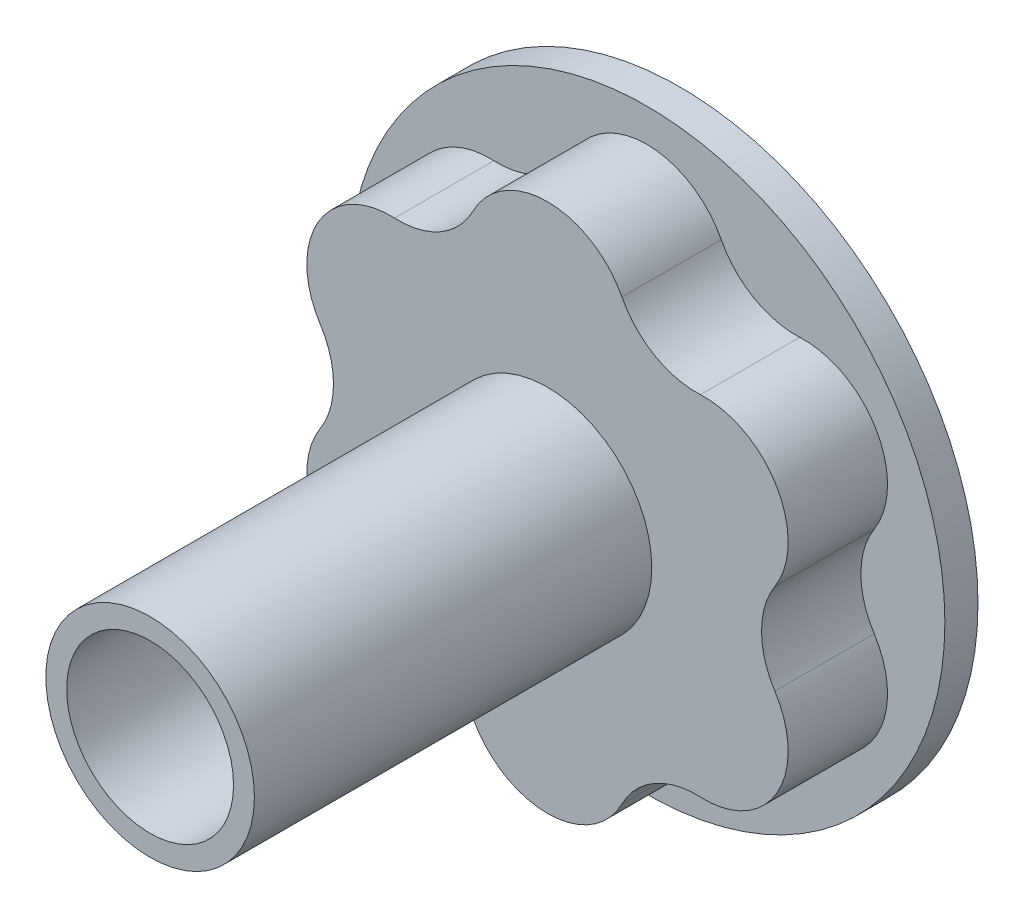
ISO-10303-21;
HEADER;
FILE_DESCRIPTION(('STEP AP214'),'2;1');
FILE_NAME('part.step','',(''),(''),'','','');
FILE_SCHEMA(('AUTOMOTIVE_DESIGN { 1 0 10303 214 1 1 1 1 }'));
ENDSEC;
DATA;
#1=APPLICATION_CONTEXT('core data for automotive mechanical design processes');
#2=APPLICATION_PROTOCOL_DEFINITION('international standard','automotive_design',2000,#1);
#3=PRODUCT_CONTEXT('',#1,'mechanical');
#4=PRODUCT('Part','Part','',(#3));
#5=PRODUCT_RELATED_PRODUCT_CATEGORY('part','',(#4));
#6=PRODUCT_DEFINITION_FORMATION('','',#4);
#7=PRODUCT_DEFINITION_CONTEXT('part definition',#1,'design');
#8=PRODUCT_DEFINITION('design','',#6,#7);
#9=PRODUCT_DEFINITION_SHAPE('','',#8);
#10=(LENGTH_UNIT() NAMED_UNIT(*) SI_UNIT(.MILLI.,.METRE.));
#11=(NAMED_UNIT(*) PLANE_ANGLE_UNIT() SI_UNIT($,.RADIAN.));
#12=(NAMED_UNIT(*) SI_UNIT($,.STERADIAN.) SOLID_ANGLE_UNIT());
#13=UNCERTAINTY_MEASURE_WITH_UNIT(LENGTH_MEASURE(1.E-05),#10,'distance_accuracy_value','');
#14=(GEOMETRIC_REPRESENTATION_CONTEXT(3) GLOBAL_UNCERTAINTY_ASSIGNED_CONTEXT((#13)) GLOBAL_UNIT_ASSIGNED_CONTEXT((#10,
#11,#12)) REPRESENTATION_CONTEXT('',''));
#15=CARTESIAN_POINT('',(0.,0.,0.));
#16=DIRECTION('',(0.,0.,1.));
#17=DIRECTION('',(1.,0.,0.));
#18=AXIS2_PLACEMENT_3D('',#15,#16,#17);
#19=CARTESIAN_POINT('',(0.,0.,4.7625));
#20=DIRECTION('',(0.,0.,-1.));
#21=DIRECTION('',(-1.,0.,0.));
#22=AXIS2_PLACEMENT_3D('',#19,#20,#21);
#23=CYLINDRICAL_SURFACE('',#22,3.);
#24=CARTESIAN_POINT('',(0.,0.,-1.5875));
#25=DIRECTION('',(0.,0.,-1.));
#26=DIRECTION('',(-1.,0.,0.));
#27=AXIS2_PLACEMENT_3D('',#24,#25,#26);
#28=CIRCLE('',#27,3.);
#29=CARTESIAN_POINT('',(-3.,0.,-1.5875));
#30=VERTEX_POINT('',#29);
#31=EDGE_CURVE('E239',#30,#30,#28,.T.);
#32=ORIENTED_EDGE('',*,*,#31,.T.);
#33=EDGE_LOOP('',(#32));
#34=FACE_BOUND('',#33,.T.);
#35=CARTESIAN_POINT('',(0.,0.,14.2875));
#36=DIRECTION('',(0.,0.,1.));
#37=DIRECTION('',(1.,0.,0.));
#38=AXIS2_PLACEMENT_3D('',#35,#36,#37);
#39=CIRCLE('',#38,3.);
#40=CARTESIAN_POINT('',(3.,0.,14.2875));
#41=VERTEX_POINT('',#40);
#42=EDGE_CURVE('E38',#41,#41,#39,.T.);
#43=ORIENTED_EDGE('',*,*,#42,.T.);
#44=EDGE_LOOP('',(#43));
#45=FACE_BOUND('',#44,.T.);
#46=ADVANCED_FACE('F34',(#34,#45),#23,.F.);
#47=CARTESIAN_POINT('',(-3.56859262190217,10.5239157612034,4.7625));
#48=DIRECTION('',(0.,0.,1.));
#49=DIRECTION('',(1.,0.,0.));
#50=AXIS2_PLACEMENT_3D('',#47,#48,#49);
#51=PLANE('',#50);
#52=CARTESIAN_POINT('',(-7.13718524380433,12.3619674653,4.7625));
#53=DIRECTION('',(0.,0.,-1.));
#54=DIRECTION('',(1.,0.,0.));
#55=AXIS2_PLACEMENT_3D('',#52,#53,#54);
#56=CIRCLE('',#55,4.0141359428932);
#57=CARTESIAN_POINT('',(-3.56859262190216,10.5239157612034,4.7625));
#58=VERTEX_POINT('',#57);
#59=CARTESIAN_POINT('',(-7.32968208553849,8.35244974692671,4.7625));
#60=VERTEX_POINT('',#59);
#61=EDGE_CURVE('E174',#58,#60,#56,.T.);
#62=ORIENTED_EDGE('',*,*,#61,.T.);
#63=CARTESIAN_POINT('',(-7.52217892727266,4.34293202855341,4.7625));
#64=DIRECTION('',(0.,0.,1.));
#65=DIRECTION('',(-1.,0.,0.));
#66=AXIS2_PLACEMENT_3D('',#63,#64,#65);
#67=CIRCLE('',#66,4.0141359428932);
#68=CARTESIAN_POINT('',(-10.8982747074407,2.17146601427671,4.7625));
#69=VERTEX_POINT('',#68);
#70=EDGE_CURVE('E134',#60,#69,#67,.T.);
#71=ORIENTED_EDGE('',*,*,#70,.T.);
#72=CARTESIAN_POINT('',(-14.2743704876087,0.,4.7625));
#73=DIRECTION('',(0.,0.,-1.));
#74=DIRECTION('',(1.,0.,0.));
#75=AXIS2_PLACEMENT_3D('',#72,#73,#74);
#76=CIRCLE('',#75,4.0141359428932);
#77=CARTESIAN_POINT('',(-10.8982747074407,-2.1714660142767,4.7625));
#78=VERTEX_POINT('',#77);
#79=EDGE_CURVE('E207',#69,#78,#76,.T.);
#80=ORIENTED_EDGE('',*,*,#79,.T.);
#81=CARTESIAN_POINT('',(-7.52217892727266,-4.3429320285534,4.7625));
#82=DIRECTION('',(0.,0.,1.));
#83=DIRECTION('',(-1.,0.,0.));
#84=AXIS2_PLACEMENT_3D('',#81,#82,#83);
#85=CIRCLE('',#84,4.0141359428932);
#86=CARTESIAN_POINT('',(-7.32968208553851,-8.3524497469267,4.7625));
#87=VERTEX_POINT('',#86);
#88=EDGE_CURVE('E209',#78,#87,#85,.T.);
#89=ORIENTED_EDGE('',*,*,#88,.T.);
#90=CARTESIAN_POINT('',(-7.13718524380435,-12.3619674653,4.7625));
#91=DIRECTION('',(0.,0.,-1.));
#92=DIRECTION('',(1.,0.,0.));
#93=AXIS2_PLACEMENT_3D('',#90,#91,#92);
#94=CIRCLE('',#93,4.0141359428932);
#95=CARTESIAN_POINT('',(-3.56859262190217,-10.5239157612034,4.7625));
#96=VERTEX_POINT('',#95);
#97=EDGE_CURVE('E211',#87,#96,#94,.T.);
#98=ORIENTED_EDGE('',*,*,#97,.T.);
#99=CARTESIAN_POINT('',(0.,-8.6858640571068,4.7625));
#100=DIRECTION('',(0.,0.,1.));
#101=DIRECTION('',(-1.,0.,0.));
#102=AXIS2_PLACEMENT_3D('',#99,#100,#101);
#103=CIRCLE('',#102,4.0141359428932);
#104=CARTESIAN_POINT('',(3.56859262190218,-10.5239157612034,4.7625));
#105=VERTEX_POINT('',#104);
#106=EDGE_CURVE('E217',#96,#105,#103,.T.);
#107=ORIENTED_EDGE('',*,*,#106,.T.);
#108=CARTESIAN_POINT('',(7.13718524380436,-12.3619674653,4.7625));
#109=DIRECTION('',(0.,0.,-1.));
#110=DIRECTION('',(1.,0.,0.));
#111=AXIS2_PLACEMENT_3D('',#108,#109,#110);
#112=CIRCLE('',#111,4.0141359428932);
#113=CARTESIAN_POINT('',(7.32968208553851,-8.35244974692669,4.7625));
#114=VERTEX_POINT('',#113);
#115=EDGE_CURVE('E219',#105,#114,#112,.T.);
#116=ORIENTED_EDGE('',*,*,#115,.T.);
#117=CARTESIAN_POINT('',(7.52217892727266,-4.34293202855339,4.7625));
#118=DIRECTION('',(0.,0.,1.));
#119=DIRECTION('',(-1.,0.,0.));
#120=AXIS2_PLACEMENT_3D('',#117,#118,#119);
#121=CIRCLE('',#120,4.0141359428932);
#122=CARTESIAN_POINT('',(10.8982747074407,-2.17146601427669,4.7625));
#123=VERTEX_POINT('',#122);
#124=EDGE_CURVE('E221',#114,#123,#121,.T.);
#125=ORIENTED_EDGE('',*,*,#124,.T.);
#126=CARTESIAN_POINT('',(14.2743704876087,0.,4.7625));
#127=DIRECTION('',(0.,0.,-1.));
#128=DIRECTION('',(1.,0.,0.));
#129=AXIS2_PLACEMENT_3D('',#126,#127,#128);
#130=CIRCLE('',#129,4.0141359428932);
#131=CARTESIAN_POINT('',(10.8982747074407,2.17146601427671,4.7625));
#132=VERTEX_POINT('',#131);
#133=EDGE_CURVE('E223',#123,#132,#130,.T.);
#134=ORIENTED_EDGE('',*,*,#133,.T.);
#135=CARTESIAN_POINT('',(7.52217892727265,4.3429320285534,4.7625));
#136=DIRECTION('',(0.,0.,1.));
#137=DIRECTION('',(-1.,0.,0.));
#138=AXIS2_PLACEMENT_3D('',#135,#136,#137);
#139=CIRCLE('',#138,4.0141359428932);
#140=CARTESIAN_POINT('',(7.3296820855385,8.3524497469267,4.7625));
#141=VERTEX_POINT('',#140);
#142=EDGE_CURVE('E225',#132,#141,#139,.T.);
#143=ORIENTED_EDGE('',*,*,#142,.T.);
#144=CARTESIAN_POINT('',(7.13718524380435,12.3619674653,4.7625));
#145=DIRECTION('',(0.,0.,-1.));
#146=DIRECTION('',(1.,0.,0.));
#147=AXIS2_PLACEMENT_3D('',#144,#145,#146);
#148=CIRCLE('',#147,4.0141359428932);
#149=CARTESIAN_POINT('',(3.56859262190217,10.5239157612034,4.7625));
#150=VERTEX_POINT('',#149);
#151=EDGE_CURVE('E226',#141,#150,#148,.T.);
#152=ORIENTED_EDGE('',*,*,#151,.T.);
#153=CARTESIAN_POINT('',(0.,8.6858640571068,4.7625));
#154=DIRECTION('',(0.,0.,1.));
#155=DIRECTION('',(-1.,0.,0.));
#156=AXIS2_PLACEMENT_3D('',#153,#154,#155);
#157=CIRCLE('',#156,4.01413594289319);
#158=EDGE_CURVE('E51',#150,#58,#157,.T.);
#159=ORIENTED_EDGE('',*,*,#158,.T.);
#160=EDGE_LOOP('',(#62,#71,#80,#89,#98,#107,#116,#125,#134,#143,#152,#159));
#161=FACE_BOUND('',#160,.T.);
#162=CARTESIAN_POINT('',(0.,0.,4.7625));
#163=DIRECTION('',(0.,0.,1.));
#164=DIRECTION('',(1.,0.,0.));
#165=AXIS2_PLACEMENT_3D('',#162,#163,#164);
#166=CIRCLE('',#165,5.);
#167=CARTESIAN_POINT('',(5.,0.,4.7625));
#168=VERTEX_POINT('',#167);
#169=EDGE_CURVE('E244',#168,#168,#166,.T.);
#170=ORIENTED_EDGE('',*,*,#169,.F.);
#171=EDGE_LOOP('',(#170));
#172=FACE_BOUND('',#171,.T.);
#173=ADVANCED_FACE('F229',(#161,#172),#51,.T.);
#174=CARTESIAN_POINT('',(-7.13718524380433,12.3619674653,4.7625));
#175=DIRECTION('',(0.,0.,-1.));
#176=DIRECTION('',(-1.,0.,0.));
#177=AXIS2_PLACEMENT_3D('',#174,#175,#176);
#178=CYLINDRICAL_SURFACE('',#177,4.0141359428932);
#179=CARTESIAN_POINT('',(-7.13718524380433,12.3619674653,0.));
#180=DIRECTION('',(0.,0.,-1.));
#181=DIRECTION('',(1.,0.,0.));
#182=AXIS2_PLACEMENT_3D('',#179,#180,#181);
#183=CIRCLE('',#182,4.0141359428932);
#184=CARTESIAN_POINT('',(-3.56859262190216,10.5239157612034,0.));
#185=VERTEX_POINT('',#184);
#186=CARTESIAN_POINT('',(-7.32968208553849,8.35244974692671,0.));
#187=VERTEX_POINT('',#186);
#188=EDGE_CURVE('E124',#185,#187,#183,.T.);
#189=ORIENTED_EDGE('',*,*,#188,.T.);
#190=DIRECTION('',(0.,0.,-1.));
#191=VECTOR('',#190,1.);
#192=CARTESIAN_POINT('',(-7.32968208553849,8.35244974692671,4.7625));
#193=LINE('',#192,#191);
#194=EDGE_CURVE('E11',#60,#187,#193,.T.);
#195=ORIENTED_EDGE('',*,*,#194,.F.);
#196=ORIENTED_EDGE('',*,*,#61,.F.);
#197=DIRECTION('',(0.,0.,-1.));
#198=VECTOR('',#197,1.);
#199=CARTESIAN_POINT('',(-3.56859262190216,10.5239157612034,4.7625));
#200=LINE('',#199,#198);
#201=EDGE_CURVE('E138',#58,#185,#200,.T.);
#202=ORIENTED_EDGE('',*,*,#201,.T.);
#203=EDGE_LOOP('',(#189,#195,#196,#202));
#204=FACE_BOUND('',#203,.T.);
#205=ADVANCED_FACE('F36',(#204),#178,.F.);
#206=CARTESIAN_POINT('',(-7.52217892727266,4.34293202855341,4.7625));
#207=DIRECTION('',(0.,0.,-1.));
#208=DIRECTION('',(-1.,0.,0.));
#209=AXIS2_PLACEMENT_3D('',#206,#207,#208);
#210=CYLINDRICAL_SURFACE('',#209,4.0141359428932);
#211=CARTESIAN_POINT('',(-7.52217892727266,4.34293202855341,0.));
#212=DIRECTION('',(0.,0.,1.));
#213=DIRECTION('',(-1.,0.,0.));
#214=AXIS2_PLACEMENT_3D('',#211,#212,#213);
#215=CIRCLE('',#214,4.0141359428932);
#216=CARTESIAN_POINT('',(-10.8982747074407,2.17146601427671,0.));
#217=VERTEX_POINT('',#216);
#218=EDGE_CURVE('E120',#187,#217,#215,.T.);
#219=ORIENTED_EDGE('',*,*,#218,.T.);
#220=DIRECTION('',(0.,0.,-1.));
#221=VECTOR('',#220,1.);
#222=CARTESIAN_POINT('',(-10.8982747074407,2.17146601427671,4.7625));
#223=LINE('',#222,#221);
#224=EDGE_CURVE('E44',#69,#217,#223,.T.);
#225=ORIENTED_EDGE('',*,*,#224,.F.);
#226=ORIENTED_EDGE('',*,*,#70,.F.);
#227=ORIENTED_EDGE('',*,*,#194,.T.);
#228=EDGE_LOOP('',(#219,#225,#226,#227));
#229=FACE_BOUND('',#228,.T.);
#230=ADVANCED_FACE('F133',(#229),#210,.T.);
#231=CARTESIAN_POINT('',(-14.2743704876087,0.,4.7625));
#232=DIRECTION('',(0.,0.,-1.));
#233=DIRECTION('',(-1.,0.,0.));
#234=AXIS2_PLACEMENT_3D('',#231,#232,#233);
#235=CYLINDRICAL_SURFACE('',#234,4.0141359428932);
#236=CARTESIAN_POINT('',(-14.2743704876087,0.,0.));
#237=DIRECTION('',(0.,0.,-1.));
#238=DIRECTION('',(1.,0.,0.));
#239=AXIS2_PLACEMENT_3D('',#236,#237,#238);
#240=CIRCLE('',#239,4.0141359428932);
#241=CARTESIAN_POINT('',(-10.8982747074407,-2.1714660142767,0.));
#242=VERTEX_POINT('',#241);
#243=EDGE_CURVE('E127',#217,#242,#240,.T.);
#244=ORIENTED_EDGE('',*,*,#243,.T.);
#245=DIRECTION('',(0.,0.,-1.));
#246=VECTOR('',#245,1.);
#247=CARTESIAN_POINT('',(-10.8982747074407,-2.1714660142767,4.7625));
#248=LINE('',#247,#246);
#249=EDGE_CURVE('E200',#78,#242,#248,.T.);
#250=ORIENTED_EDGE('',*,*,#249,.F.);
#251=ORIENTED_EDGE('',*,*,#79,.F.);
#252=ORIENTED_EDGE('',*,*,#224,.T.);
#253=EDGE_LOOP('',(#244,#250,#251,#252));
#254=FACE_BOUND('',#253,.T.);
#255=ADVANCED_FACE('F205',(#254),#235,.F.);
#256=CARTESIAN_POINT('',(-7.52217892727266,-4.3429320285534,4.7625));
#257=DIRECTION('',(0.,0.,-1.));
#258=DIRECTION('',(-1.,0.,0.));
#259=AXIS2_PLACEMENT_3D('',#256,#257,#258);
#260=CYLINDRICAL_SURFACE('',#259,4.0141359428932);
#261=CARTESIAN_POINT('',(-7.52217892727266,-4.3429320285534,0.));
#262=DIRECTION('',(0.,0.,1.));
#263=DIRECTION('',(-1.,0.,0.));
#264=AXIS2_PLACEMENT_3D('',#261,#262,#263);
#265=CIRCLE('',#264,4.0141359428932);
#266=CARTESIAN_POINT('',(-7.32968208553851,-8.3524497469267,0.));
#267=VERTEX_POINT('',#266);
#268=EDGE_CURVE('E148',#242,#267,#265,.T.);
#269=ORIENTED_EDGE('',*,*,#268,.T.);
#270=DIRECTION('',(0.,0.,-1.));
#271=VECTOR('',#270,1.);
#272=CARTESIAN_POINT('',(-7.32968208553851,-8.3524497469267,4.7625));
#273=LINE('',#272,#271);
#274=EDGE_CURVE('E197',#87,#267,#273,.T.);
#275=ORIENTED_EDGE('',*,*,#274,.F.);
#276=ORIENTED_EDGE('',*,*,#88,.F.);
#277=ORIENTED_EDGE('',*,*,#249,.T.);
#278=EDGE_LOOP('',(#269,#275,#276,#277));
#279=FACE_BOUND('',#278,.T.);
#280=ADVANCED_FACE('F309',(#279),#260,.T.);
#281=CARTESIAN_POINT('',(-7.13718524380435,-12.3619674653,4.7625));
#282=DIRECTION('',(0.,0.,-1.));
#283=DIRECTION('',(-1.,0.,0.));
#284=AXIS2_PLACEMENT_3D('',#281,#282,#283);
#285=CYLINDRICAL_SURFACE('',#284,4.0141359428932);
#286=CARTESIAN_POINT('',(-7.13718524380435,-12.3619674653,0.));
#287=DIRECTION('',(0.,0.,-1.));
#288=DIRECTION('',(1.,0.,0.));
#289=AXIS2_PLACEMENT_3D('',#286,#287,#288);
#290=CIRCLE('',#289,4.0141359428932);
#291=CARTESIAN_POINT('',(-3.56859262190217,-10.5239157612034,0.));
#292=VERTEX_POINT('',#291);
#293=EDGE_CURVE('E151',#267,#292,#290,.T.);
#294=ORIENTED_EDGE('',*,*,#293,.T.);
#295=DIRECTION('',(0.,0.,-1.));
#296=VECTOR('',#295,1.);
#297=CARTESIAN_POINT('',(-3.56859262190217,-10.5239157612034,4.7625));
#298=LINE('',#297,#296);
#299=EDGE_CURVE('E194',#96,#292,#298,.T.);
#300=ORIENTED_EDGE('',*,*,#299,.F.);
#301=ORIENTED_EDGE('',*,*,#97,.F.);
#302=ORIENTED_EDGE('',*,*,#274,.T.);
#303=EDGE_LOOP('',(#294,#300,#301,#302));
#304=FACE_BOUND('',#303,.T.);
#305=ADVANCED_FACE('F305',(#304),#285,.F.);
#306=CARTESIAN_POINT('',(0.,-8.6858640571068,4.7625));
#307=DIRECTION('',(0.,0.,-1.));
#308=DIRECTION('',(-1.,0.,0.));
#309=AXIS2_PLACEMENT_3D('',#306,#307,#308);
#310=CYLINDRICAL_SURFACE('',#309,4.0141359428932);
#311=CARTESIAN_POINT('',(0.,-8.6858640571068,0.));
#312=DIRECTION('',(0.,0.,1.));
#313=DIRECTION('',(-1.,0.,0.));
#314=AXIS2_PLACEMENT_3D('',#311,#312,#313);
#315=CIRCLE('',#314,4.0141359428932);
#316=CARTESIAN_POINT('',(3.56859262190218,-10.5239157612034,0.));
#317=VERTEX_POINT('',#316);
#318=EDGE_CURVE('E154',#292,#317,#315,.T.);
#319=ORIENTED_EDGE('',*,*,#318,.T.);
#320=DIRECTION('',(0.,0.,-1.));
#321=VECTOR('',#320,1.);
#322=CARTESIAN_POINT('',(3.56859262190218,-10.5239157612034,4.7625));
#323=LINE('',#322,#321);
#324=EDGE_CURVE('E191',#105,#317,#323,.T.);
#325=ORIENTED_EDGE('',*,*,#324,.F.);
#326=ORIENTED_EDGE('',*,*,#106,.F.);
#327=ORIENTED_EDGE('',*,*,#299,.T.);
#328=EDGE_LOOP('',(#319,#325,#326,#327));
#329=FACE_BOUND('',#328,.T.);
#330=ADVANCED_FACE('F301',(#329),#310,.T.);
#331=CARTESIAN_POINT('',(7.13718524380436,-12.3619674653,4.7625));
#332=DIRECTION('',(0.,0.,-1.));
#333=DIRECTION('',(-1.,0.,0.));
#334=AXIS2_PLACEMENT_3D('',#331,#332,#333);
#335=CYLINDRICAL_SURFACE('',#334,4.0141359428932);
#336=CARTESIAN_POINT('',(7.13718524380436,-12.3619674653,0.));
#337=DIRECTION('',(0.,0.,-1.));
#338=DIRECTION('',(1.,0.,0.));
#339=AXIS2_PLACEMENT_3D('',#336,#337,#338);
#340=CIRCLE('',#339,4.0141359428932);
#341=CARTESIAN_POINT('',(7.32968208553851,-8.35244974692669,0.));
#342=VERTEX_POINT('',#341);
#343=EDGE_CURVE('E157',#317,#342,#340,.T.);
#344=ORIENTED_EDGE('',*,*,#343,.T.);
#345=DIRECTION('',(0.,0.,-1.));
#346=VECTOR('',#345,1.);
#347=CARTESIAN_POINT('',(7.32968208553851,-8.35244974692669,4.7625));
#348=LINE('',#347,#346);
#349=EDGE_CURVE('E188',#114,#342,#348,.T.);
#350=ORIENTED_EDGE('',*,*,#349,.F.);
#351=ORIENTED_EDGE('',*,*,#115,.F.);
#352=ORIENTED_EDGE('',*,*,#324,.T.);
#353=EDGE_LOOP('',(#344,#350,#351,#352));
#354=FACE_BOUND('',#353,.T.);
#355=ADVANCED_FACE('F297',(#354),#335,.F.);
#356=CARTESIAN_POINT('',(7.52217892727266,-4.34293202855339,4.7625));
#357=DIRECTION('',(0.,0.,-1.));
#358=DIRECTION('',(-1.,0.,0.));
#359=AXIS2_PLACEMENT_3D('',#356,#357,#358);
#360=CYLINDRICAL_SURFACE('',#359,4.0141359428932);
#361=CARTESIAN_POINT('',(7.52217892727266,-4.34293202855339,0.));
#362=DIRECTION('',(0.,0.,1.));
#363=DIRECTION('',(-1.,0.,0.));
#364=AXIS2_PLACEMENT_3D('',#361,#362,#363);
#365=CIRCLE('',#364,4.0141359428932);
#366=CARTESIAN_POINT('',(10.8982747074407,-2.17146601427669,0.));
#367=VERTEX_POINT('',#366);
#368=EDGE_CURVE('E160',#342,#367,#365,.T.);
#369=ORIENTED_EDGE('',*,*,#368,.T.);
#370=DIRECTION('',(0.,0.,-1.));
#371=VECTOR('',#370,1.);
#372=CARTESIAN_POINT('',(10.8982747074407,-2.17146601427669,4.7625));
#373=LINE('',#372,#371);
#374=EDGE_CURVE('E185',#123,#367,#373,.T.);
#375=ORIENTED_EDGE('',*,*,#374,.F.);
#376=ORIENTED_EDGE('',*,*,#124,.F.);
#377=ORIENTED_EDGE('',*,*,#349,.T.);
#378=EDGE_LOOP('',(#369,#375,#376,#377));
#379=FACE_BOUND('',#378,.T.);
#380=ADVANCED_FACE('F293',(#379),#360,.T.);
#381=CARTESIAN_POINT('',(14.2743704876087,0.,4.7625));
#382=DIRECTION('',(0.,0.,-1.));
#383=DIRECTION('',(-1.,0.,0.));
#384=AXIS2_PLACEMENT_3D('',#381,#382,#383);
#385=CYLINDRICAL_SURFACE('',#384,4.0141359428932);
#386=CARTESIAN_POINT('',(14.2743704876087,0.,0.));
#387=DIRECTION('',(0.,0.,-1.));
#388=DIRECTION('',(1.,0.,0.));
#389=AXIS2_PLACEMENT_3D('',#386,#387,#388);
#390=CIRCLE('',#389,4.0141359428932);
#391=CARTESIAN_POINT('',(10.8982747074407,2.17146601427671,0.));
#392=VERTEX_POINT('',#391);
#393=EDGE_CURVE('E163',#367,#392,#390,.T.);
#394=ORIENTED_EDGE('',*,*,#393,.T.);
#395=DIRECTION('',(0.,0.,-1.));
#396=VECTOR('',#395,1.);
#397=CARTESIAN_POINT('',(10.8982747074407,2.17146601427671,4.7625));
#398=LINE('',#397,#396);
#399=EDGE_CURVE('E182',#132,#392,#398,.T.);
#400=ORIENTED_EDGE('',*,*,#399,.F.);
#401=ORIENTED_EDGE('',*,*,#133,.F.);
#402=ORIENTED_EDGE('',*,*,#374,.T.);
#403=EDGE_LOOP('',(#394,#400,#401,#402));
#404=FACE_BOUND('',#403,.T.);
#405=ADVANCED_FACE('F289',(#404),#385,.F.);
#406=CARTESIAN_POINT('',(7.52217892727265,4.3429320285534,4.7625));
#407=DIRECTION('',(0.,0.,-1.));
#408=DIRECTION('',(-1.,0.,0.));
#409=AXIS2_PLACEMENT_3D('',#406,#407,#408);
#410=CYLINDRICAL_SURFACE('',#409,4.0141359428932);
#411=CARTESIAN_POINT('',(7.52217892727265,4.3429320285534,0.));
#412=DIRECTION('',(0.,0.,1.));
#413=DIRECTION('',(-1.,0.,0.));
#414=AXIS2_PLACEMENT_3D('',#411,#412,#413);
#415=CIRCLE('',#414,4.0141359428932);
#416=CARTESIAN_POINT('',(7.3296820855385,8.3524497469267,0.));
#417=VERTEX_POINT('',#416);
#418=EDGE_CURVE('E166',#392,#417,#415,.T.);
#419=ORIENTED_EDGE('',*,*,#418,.T.);
#420=DIRECTION('',(0.,0.,-1.));
#421=VECTOR('',#420,1.);
#422=CARTESIAN_POINT('',(7.3296820855385,8.3524497469267,4.7625));
#423=LINE('',#422,#421);
#424=EDGE_CURVE('E179',#141,#417,#423,.T.);
#425=ORIENTED_EDGE('',*,*,#424,.F.);
#426=ORIENTED_EDGE('',*,*,#142,.F.);
#427=ORIENTED_EDGE('',*,*,#399,.T.);
#428=EDGE_LOOP('',(#419,#425,#426,#427));
#429=FACE_BOUND('',#428,.T.);
#430=ADVANCED_FACE('F286',(#429),#410,.T.);
#431=CARTESIAN_POINT('',(7.13718524380435,12.3619674653,4.7625));
#432=DIRECTION('',(0.,0.,-1.));
#433=DIRECTION('',(-1.,0.,0.));
#434=AXIS2_PLACEMENT_3D('',#431,#432,#433);
#435=CYLINDRICAL_SURFACE('',#434,4.0141359428932);
#436=CARTESIAN_POINT('',(7.13718524380435,12.3619674653,0.));
#437=DIRECTION('',(0.,0.,-1.));
#438=DIRECTION('',(1.,0.,0.));
#439=AXIS2_PLACEMENT_3D('',#436,#437,#438);
#440=CIRCLE('',#439,4.0141359428932);
#441=CARTESIAN_POINT('',(3.56859262190217,10.5239157612034,0.));
#442=VERTEX_POINT('',#441);
#443=EDGE_CURVE('E169',#417,#442,#440,.T.);
#444=ORIENTED_EDGE('',*,*,#443,.T.);
#445=DIRECTION('',(0.,0.,-1.));
#446=VECTOR('',#445,1.);
#447=CARTESIAN_POINT('',(3.56859262190217,10.5239157612034,4.7625));
#448=LINE('',#447,#446);
#449=EDGE_CURVE('E176',#150,#442,#448,.T.);
#450=ORIENTED_EDGE('',*,*,#449,.F.);
#451=ORIENTED_EDGE('',*,*,#151,.F.);
#452=ORIENTED_EDGE('',*,*,#424,.T.);
#453=EDGE_LOOP('',(#444,#450,#451,#452));
#454=FACE_BOUND('',#453,.T.);
#455=ADVANCED_FACE('F234',(#454),#435,.F.);
#456=CARTESIAN_POINT('',(0.,8.6858640571068,4.7625));
#457=DIRECTION('',(0.,0.,-1.));
#458=DIRECTION('',(-1.,0.,0.));
#459=AXIS2_PLACEMENT_3D('',#456,#457,#458);
#460=CYLINDRICAL_SURFACE('',#459,4.01413594289319);
#461=CARTESIAN_POINT('',(0.,8.6858640571068,0.));
#462=DIRECTION('',(0.,0.,1.));
#463=DIRECTION('',(-1.,0.,0.));
#464=AXIS2_PLACEMENT_3D('',#461,#462,#463);
#465=CIRCLE('',#464,4.01413594289319);
#466=EDGE_CURVE('E172',#442,#185,#465,.T.);
#467=ORIENTED_EDGE('',*,*,#466,.T.);
#468=ORIENTED_EDGE('',*,*,#201,.F.);
#469=ORIENTED_EDGE('',*,*,#158,.F.);
#470=ORIENTED_EDGE('',*,*,#449,.T.);
#471=EDGE_LOOP('',(#467,#468,#469,#470));
#472=FACE_BOUND('',#471,.T.);
#473=ADVANCED_FACE('F236',(#472),#460,.T.);
#474=CARTESIAN_POINT('',(0.,0.,-1.5875));
#475=DIRECTION('',(0.,0.,-1.));
#476=DIRECTION('',(-1.,0.,0.));
#477=AXIS2_PLACEMENT_3D('',#474,#475,#476);
#478=PLANE('',#477);
#479=CARTESIAN_POINT('',(0.,0.,-1.5875));
#480=DIRECTION('',(0.,0.,-1.));
#481=DIRECTION('',(-1.,0.,0.));
#482=AXIS2_PLACEMENT_3D('',#479,#480,#481);
#483=CIRCLE('',#482,14.2875);
#484=CARTESIAN_POINT('',(-14.2875,0.,-1.5875));
#485=VERTEX_POINT('',#484);
#486=EDGE_CURVE('E139',#485,#485,#483,.T.);
#487=ORIENTED_EDGE('',*,*,#486,.T.);
#488=EDGE_LOOP('',(#487));
#489=FACE_BOUND('',#488,.T.);
#490=ORIENTED_EDGE('',*,*,#31,.F.);
#491=EDGE_LOOP('',(#490));
#492=FACE_BOUND('',#491,.T.);
#493=ADVANCED_FACE('F283',(#489,#492),#478,.T.);
#494=CARTESIAN_POINT('',(0.,0.,0.));
#495=DIRECTION('',(0.,0.,-1.));
#496=DIRECTION('',(-1.,0.,0.));
#497=AXIS2_PLACEMENT_3D('',#494,#495,#496);
#498=PLANE('',#497);
#499=ORIENTED_EDGE('',*,*,#188,.F.);
#500=ORIENTED_EDGE('',*,*,#466,.F.);
#501=ORIENTED_EDGE('',*,*,#443,.F.);
#502=ORIENTED_EDGE('',*,*,#418,.F.);
#503=ORIENTED_EDGE('',*,*,#393,.F.);
#504=ORIENTED_EDGE('',*,*,#368,.F.);
#505=ORIENTED_EDGE('',*,*,#343,.F.);
#506=ORIENTED_EDGE('',*,*,#318,.F.);
#507=ORIENTED_EDGE('',*,*,#293,.F.);
#508=ORIENTED_EDGE('',*,*,#268,.F.);
#509=ORIENTED_EDGE('',*,*,#243,.F.);
#510=ORIENTED_EDGE('',*,*,#218,.F.);
#511=EDGE_LOOP('',(#499,#500,#501,#502,#503,#504,#505,#506,#507,#508,#509,#510));
#512=FACE_BOUND('',#511,.T.);
#513=CARTESIAN_POINT('',(0.,0.,0.));
#514=DIRECTION('',(0.,0.,-1.));
#515=DIRECTION('',(-1.,0.,0.));
#516=AXIS2_PLACEMENT_3D('',#513,#514,#515);
#517=CIRCLE('',#516,14.2875);
#518=CARTESIAN_POINT('',(-14.2875,0.,0.));
#519=VERTEX_POINT('',#518);
#520=EDGE_CURVE('E142',#519,#519,#517,.T.);
#521=ORIENTED_EDGE('',*,*,#520,.F.);
#522=EDGE_LOOP('',(#521));
#523=FACE_BOUND('',#522,.T.);
#524=ADVANCED_FACE('F121',(#512,#523),#498,.F.);
#525=CARTESIAN_POINT('',(0.,0.,-1.5875));
#526=DIRECTION('',(0.,0.,1.));
#527=DIRECTION('',(1.,0.,0.));
#528=AXIS2_PLACEMENT_3D('',#525,#526,#527);
#529=CYLINDRICAL_SURFACE('',#528,14.2875);
#530=ORIENTED_EDGE('',*,*,#486,.F.);
#531=EDGE_LOOP('',(#530));
#532=FACE_BOUND('',#531,.T.);
#533=ORIENTED_EDGE('',*,*,#520,.T.);
#534=EDGE_LOOP('',(#533));
#535=FACE_BOUND('',#534,.T.);
#536=ADVANCED_FACE('F278',(#532,#535),#529,.T.);
#537=CARTESIAN_POINT('',(0.,0.,23.8125));
#538=DIRECTION('',(0.,0.,1.));
#539=DIRECTION('',(1.,0.,0.));
#540=AXIS2_PLACEMENT_3D('',#537,#538,#539);
#541=PLANE('',#540);
#542=CARTESIAN_POINT('',(0.,0.,23.8125));
#543=DIRECTION('',(0.,0.,1.));
#544=DIRECTION('',(1.,0.,0.));
#545=AXIS2_PLACEMENT_3D('',#542,#543,#544);
#546=CIRCLE('',#545,4.);
#547=CARTESIAN_POINT('',(4.,0.,23.8125));
#548=VERTEX_POINT('',#547);
#549=EDGE_CURVE('E249',#548,#548,#546,.T.);
#550=ORIENTED_EDGE('',*,*,#549,.F.);
#551=EDGE_LOOP('',(#550));
#552=FACE_BOUND('',#551,.T.);
#553=CARTESIAN_POINT('',(0.,0.,23.8125));
#554=DIRECTION('',(0.,0.,1.));
#555=DIRECTION('',(1.,0.,0.));
#556=AXIS2_PLACEMENT_3D('',#553,#554,#555);
#557=CIRCLE('',#556,5.);
#558=CARTESIAN_POINT('',(5.,0.,23.8125));
#559=VERTEX_POINT('',#558);
#560=EDGE_CURVE('E243',#559,#559,#557,.T.);
#561=ORIENTED_EDGE('',*,*,#560,.T.);
#562=EDGE_LOOP('',(#561));
#563=FACE_BOUND('',#562,.T.);
#564=ADVANCED_FACE('F339',(#552,#563),#541,.T.);
#565=CARTESIAN_POINT('',(0.,0.,23.8125));
#566=DIRECTION('',(0.,0.,-1.));
#567=DIRECTION('',(-1.,0.,0.));
#568=AXIS2_PLACEMENT_3D('',#565,#566,#567);
#569=CYLINDRICAL_SURFACE('',#568,5.);
#570=ORIENTED_EDGE('',*,*,#560,.F.);
#571=EDGE_LOOP('',(#570));
#572=FACE_BOUND('',#571,.T.);
#573=ORIENTED_EDGE('',*,*,#169,.T.);
#574=EDGE_LOOP('',(#573));
#575=FACE_BOUND('',#574,.T.);
#576=ADVANCED_FACE('F267',(#572,#575),#569,.T.);
#577=CARTESIAN_POINT('',(0.,0.,14.2875));
#578=DIRECTION('',(0.,0.,1.));
#579=DIRECTION('',(1.,0.,0.));
#580=AXIS2_PLACEMENT_3D('',#577,#578,#579);
#581=CYLINDRICAL_SURFACE('',#580,4.);
#582=CARTESIAN_POINT('',(0.,0.,14.2875));
#583=DIRECTION('',(0.,0.,1.));
#584=DIRECTION('',(1.,0.,0.));
#585=AXIS2_PLACEMENT_3D('',#582,#583,#584);
#586=CIRCLE('',#585,4.);
#587=CARTESIAN_POINT('',(4.,0.,14.2875));
#588=VERTEX_POINT('',#587);
#589=EDGE_CURVE('E252',#588,#588,#586,.T.);
#590=ORIENTED_EDGE('',*,*,#589,.F.);
#591=EDGE_LOOP('',(#590));
#592=FACE_BOUND('',#591,.T.);
#593=ORIENTED_EDGE('',*,*,#549,.T.);
#594=EDGE_LOOP('',(#593));
#595=FACE_BOUND('',#594,.T.);
#596=ADVANCED_FACE('F262',(#592,#595),#581,.F.);
#597=CARTESIAN_POINT('',(0.,0.,14.2875));
#598=DIRECTION('',(0.,0.,1.));
#599=DIRECTION('',(1.,0.,0.));
#600=AXIS2_PLACEMENT_3D('',#597,#598,#599);
#601=PLANE('',#600);
#602=ORIENTED_EDGE('',*,*,#42,.F.);
#603=EDGE_LOOP('',(#602));
#604=FACE_BOUND('',#603,.T.);
#605=ORIENTED_EDGE('',*,*,#589,.T.);
#606=EDGE_LOOP('',(#605));
#607=FACE_BOUND('',#606,.T.);
#608=ADVANCED_FACE('F260',(#604,#607),#601,.T.);
#609=CLOSED_SHELL('',(#46,#173,#205,#230,#255,#280,#305,#330,#355,#380,#405,#430,#455,#473,#493,
#524,#536,#564,#576,#596,#608));
#610=MANIFOLD_SOLID_BREP('B2',#609);
#611=ADVANCED_BREP_SHAPE_REPRESENTATION('',(#18,#610),#14);
#612=SHAPE_DEFINITION_REPRESENTATION(#9,#611);
ENDSEC;
END-ISO-10303-21;
